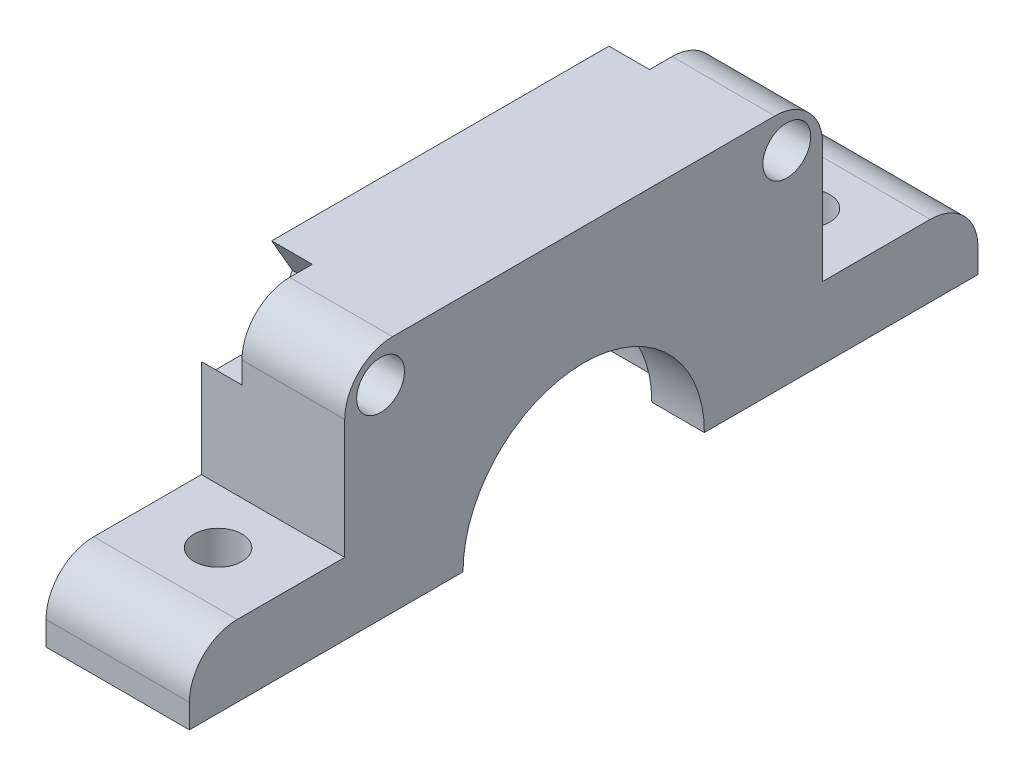
ISO-10303-21;
HEADER;
FILE_DESCRIPTION(('STEP AP214'),'2;1');
FILE_NAME('part.step','',(''),(''),'','','');
FILE_SCHEMA(('AUTOMOTIVE_DESIGN { 1 0 10303 214 1 1 1 1 }'));
ENDSEC;
DATA;
#1=APPLICATION_CONTEXT('core data for automotive mechanical design processes');
#2=APPLICATION_PROTOCOL_DEFINITION('international standard','automotive_design',2000,#1);
#3=PRODUCT_CONTEXT('',#1,'mechanical');
#4=PRODUCT('Part','Part','',(#3));
#5=PRODUCT_RELATED_PRODUCT_CATEGORY('part','',(#4));
#6=PRODUCT_DEFINITION_FORMATION('','',#4);
#7=PRODUCT_DEFINITION_CONTEXT('part definition',#1,'design');
#8=PRODUCT_DEFINITION('design','',#6,#7);
#9=PRODUCT_DEFINITION_SHAPE('','',#8);
#10=(LENGTH_UNIT() NAMED_UNIT(*) SI_UNIT(.MILLI.,.METRE.));
#11=(NAMED_UNIT(*) PLANE_ANGLE_UNIT() SI_UNIT($,.RADIAN.));
#12=(NAMED_UNIT(*) SI_UNIT($,.STERADIAN.) SOLID_ANGLE_UNIT());
#13=UNCERTAINTY_MEASURE_WITH_UNIT(LENGTH_MEASURE(1.E-05),#10,'distance_accuracy_value','');
#14=(GEOMETRIC_REPRESENTATION_CONTEXT(3) GLOBAL_UNCERTAINTY_ASSIGNED_CONTEXT((#13)) GLOBAL_UNIT_ASSIGNED_CONTEXT((#10,
#11,#12)) REPRESENTATION_CONTEXT('',''));
#15=CARTESIAN_POINT('',(0.,0.,0.));
#16=DIRECTION('',(0.,0.,1.));
#17=DIRECTION('',(1.,0.,0.));
#18=AXIS2_PLACEMENT_3D('',#15,#16,#17);
#19=CARTESIAN_POINT('',(3.92156862745098,8.,-14.7941176470588));
#20=DIRECTION('',(1.,0.,0.));
#21=DIRECTION('',(0.,0.,-1.));
#22=AXIS2_PLACEMENT_3D('',#19,#20,#21);
#23=CYLINDRICAL_SURFACE('',#22,2.);
#24=DIRECTION('',(1.,0.,0.));
#25=VECTOR('',#24,1.);
#26=CARTESIAN_POINT('',(3.92156862745098,8.,-16.7941176470588));
#27=LINE('',#26,#25);
#28=CARTESIAN_POINT('',(5.62156862745098,8.,-16.7941176470588));
#29=VERTEX_POINT('',#28);
#30=CARTESIAN_POINT('',(9.92156862745098,8.,-16.7941176470588));
#31=VERTEX_POINT('',#30);
#32=EDGE_CURVE('E373',#29,#31,#27,.T.);
#33=ORIENTED_EDGE('',*,*,#32,.F.);
#34=CARTESIAN_POINT('',(5.62156862745098,8.,-14.7941176470588));
#35=DIRECTION('',(-1.,0.,0.));
#36=DIRECTION('',(0.,0.,1.));
#37=AXIS2_PLACEMENT_3D('',#34,#35,#36);
#38=CIRCLE('',#37,2.);
#39=CARTESIAN_POINT('',(5.62156862745098,10.,-14.7941176470588));
#40=VERTEX_POINT('',#39);
#41=EDGE_CURVE('E285',#29,#40,#38,.F.);
#42=ORIENTED_EDGE('',*,*,#41,.T.);
#43=DIRECTION('',(1.,0.,0.));
#44=VECTOR('',#43,1.);
#45=CARTESIAN_POINT('',(3.92156862745098,10.,-14.7941176470588));
#46=LINE('',#45,#44);
#47=CARTESIAN_POINT('',(9.92156862745098,10.,-14.7941176470588));
#48=VERTEX_POINT('',#47);
#49=EDGE_CURVE('E381',#48,#40,#46,.F.);
#50=ORIENTED_EDGE('',*,*,#49,.F.);
#51=CARTESIAN_POINT('',(9.92156862745098,8.,-14.7941176470588));
#52=DIRECTION('',(-1.,0.,0.));
#53=DIRECTION('',(0.,0.,1.));
#54=AXIS2_PLACEMENT_3D('',#51,#52,#53);
#55=CIRCLE('',#54,2.);
#56=EDGE_CURVE('E377',#31,#48,#55,.F.);
#57=ORIENTED_EDGE('',*,*,#56,.F.);
#58=EDGE_LOOP('',(#33,#42,#50,#57));
#59=FACE_BOUND('',#58,.T.);
#60=ADVANCED_FACE('F38',(#59),#23,.T.);
#61=CARTESIAN_POINT('',(3.92156862745098,8.,1.20588235294118));
#62=DIRECTION('',(1.,0.,0.));
#63=DIRECTION('',(0.,0.,-1.));
#64=AXIS2_PLACEMENT_3D('',#61,#62,#63);
#65=CYLINDRICAL_SURFACE('',#64,2.);
#66=DIRECTION('',(1.,0.,0.));
#67=VECTOR('',#66,1.);
#68=CARTESIAN_POINT('',(3.92156862745098,10.,1.20588235294118));
#69=LINE('',#68,#67);
#70=CARTESIAN_POINT('',(5.62156862745098,10.,1.20588235294118));
#71=VERTEX_POINT('',#70);
#72=CARTESIAN_POINT('',(9.92156862745098,10.,1.20588235294118));
#73=VERTEX_POINT('',#72);
#74=EDGE_CURVE('E379',#71,#73,#69,.T.);
#75=ORIENTED_EDGE('',*,*,#74,.F.);
#76=CARTESIAN_POINT('',(5.62156862745098,8.,1.20588235294118));
#77=DIRECTION('',(-1.,0.,0.));
#78=DIRECTION('',(0.,0.,1.));
#79=AXIS2_PLACEMENT_3D('',#76,#77,#78);
#80=CIRCLE('',#79,2.);
#81=CARTESIAN_POINT('',(5.62156862745098,8.,3.20588235294118));
#82=VERTEX_POINT('',#81);
#83=EDGE_CURVE('E280',#71,#82,#80,.F.);
#84=ORIENTED_EDGE('',*,*,#83,.T.);
#85=DIRECTION('',(1.,0.,0.));
#86=VECTOR('',#85,1.);
#87=CARTESIAN_POINT('',(3.92156862745098,8.,3.20588235294118));
#88=LINE('',#87,#86);
#89=CARTESIAN_POINT('',(9.92156862745098,7.99999999999999,3.20588235294118));
#90=VERTEX_POINT('',#89);
#91=EDGE_CURVE('E384',#90,#82,#88,.F.);
#92=ORIENTED_EDGE('',*,*,#91,.F.);
#93=CARTESIAN_POINT('',(9.92156862745098,8.,1.20588235294118));
#94=DIRECTION('',(-1.,0.,0.));
#95=DIRECTION('',(0.,0.,1.));
#96=AXIS2_PLACEMENT_3D('',#93,#94,#95);
#97=CIRCLE('',#96,2.);
#98=EDGE_CURVE('E375',#73,#90,#97,.F.);
#99=ORIENTED_EDGE('',*,*,#98,.F.);
#100=EDGE_LOOP('',(#75,#84,#92,#99));
#101=FACE_BOUND('',#100,.T.);
#102=ADVANCED_FACE('F516',(#101),#65,.T.);
#103=CARTESIAN_POINT('',(-5.07843137254902,8.5,-15.2941176470588));
#104=DIRECTION('',(1.,0.,0.));
#105=DIRECTION('',(0.,0.,-1.));
#106=AXIS2_PLACEMENT_3D('',#103,#104,#105);
#107=CYLINDRICAL_SURFACE('',#106,1.00000000000001);
#108=CARTESIAN_POINT('',(9.92156862745098,8.5,-15.2941176470588));
#109=DIRECTION('',(1.,0.,0.));
#110=DIRECTION('',(0.,0.,-1.));
#111=AXIS2_PLACEMENT_3D('',#108,#109,#110);
#112=CIRCLE('',#111,1.00000000000001);
#113=CARTESIAN_POINT('',(9.92156862745098,8.5,-16.2941176470588));
#114=VERTEX_POINT('',#113);
#115=EDGE_CURVE('E291',#114,#114,#112,.T.);
#116=ORIENTED_EDGE('',*,*,#115,.T.);
#117=EDGE_LOOP('',(#116));
#118=FACE_BOUND('',#117,.T.);
#119=CARTESIAN_POINT('',(5.62156862745098,8.5,-15.2941176470588));
#120=DIRECTION('',(-1.,0.,0.));
#121=DIRECTION('',(0.,0.,1.));
#122=AXIS2_PLACEMENT_3D('',#119,#120,#121);
#123=CIRCLE('',#122,1.00000000000001);
#124=CARTESIAN_POINT('',(5.62156862745098,8.5,-14.2941176470588));
#125=VERTEX_POINT('',#124);
#126=EDGE_CURVE('E284',#125,#125,#123,.F.);
#127=ORIENTED_EDGE('',*,*,#126,.F.);
#128=EDGE_LOOP('',(#127));
#129=FACE_BOUND('',#128,.T.);
#130=ADVANCED_FACE('F526',(#118,#129),#107,.F.);
#131=CARTESIAN_POINT('',(-5.07843137254902,8.5,1.70588235294118));
#132=DIRECTION('',(1.,0.,0.));
#133=DIRECTION('',(0.,0.,-1.));
#134=AXIS2_PLACEMENT_3D('',#131,#132,#133);
#135=CYLINDRICAL_SURFACE('',#134,1.);
#136=CARTESIAN_POINT('',(9.92156862745098,8.5,1.70588235294118));
#137=DIRECTION('',(1.,0.,0.));
#138=DIRECTION('',(0.,0.,-1.));
#139=AXIS2_PLACEMENT_3D('',#136,#137,#138);
#140=CIRCLE('',#139,1.);
#141=CARTESIAN_POINT('',(9.92156862745098,8.5,0.705882352941176));
#142=VERTEX_POINT('',#141);
#143=EDGE_CURVE('E292',#142,#142,#140,.T.);
#144=ORIENTED_EDGE('',*,*,#143,.T.);
#145=EDGE_LOOP('',(#144));
#146=FACE_BOUND('',#145,.T.);
#147=CARTESIAN_POINT('',(5.62156862745098,8.5,1.70588235294118));
#148=DIRECTION('',(-1.,0.,0.));
#149=DIRECTION('',(0.,0.,1.));
#150=AXIS2_PLACEMENT_3D('',#147,#148,#149);
#151=CIRCLE('',#150,1.);
#152=CARTESIAN_POINT('',(5.62156862745098,8.5,2.70588235294118));
#153=VERTEX_POINT('',#152);
#154=EDGE_CURVE('E252',#153,#153,#151,.F.);
#155=ORIENTED_EDGE('',*,*,#154,.F.);
#156=EDGE_LOOP('',(#155));
#157=FACE_BOUND('',#156,.T.);
#158=ADVANCED_FACE('F551',(#146,#157),#135,.F.);
#159=CARTESIAN_POINT('',(46.921568627451,0.,-6.79411764705883));
#160=DIRECTION('',(-1.,0.,0.));
#161=DIRECTION('',(0.,0.,1.));
#162=AXIS2_PLACEMENT_3D('',#159,#160,#161);
#163=CYLINDRICAL_SURFACE('',#162,5.05);
#164=CARTESIAN_POINT('',(7.72156862745098,0.,-6.79411764705883));
#165=DIRECTION('',(-1.,0.,0.));
#166=DIRECTION('',(0.,0.,1.));
#167=AXIS2_PLACEMENT_3D('',#164,#165,#166);
#168=CIRCLE('',#167,5.05);
#169=CARTESIAN_POINT('',(7.72156862745098,0.,-11.8441176470588));
#170=VERTEX_POINT('',#169);
#171=CARTESIAN_POINT('',(7.72156862745098,0.,-1.74411764705883));
#172=VERTEX_POINT('',#171);
#173=EDGE_CURVE('E392',#170,#172,#168,.F.);
#174=ORIENTED_EDGE('',*,*,#173,.F.);
#175=DIRECTION('',(-1.,0.,0.));
#176=VECTOR('',#175,1.);
#177=CARTESIAN_POINT('',(46.921568627451,0.,-11.8441176470588));
#178=LINE('',#177,#176);
#179=CARTESIAN_POINT('',(9.92156862745097,0.,-11.8441176470588));
#180=VERTEX_POINT('',#179);
#181=EDGE_CURVE('E389',#180,#170,#178,.T.);
#182=ORIENTED_EDGE('',*,*,#181,.F.);
#183=CARTESIAN_POINT('',(9.92156862745098,0.,-6.79411764705883));
#184=DIRECTION('',(-1.,0.,0.));
#185=DIRECTION('',(0.,0.,1.));
#186=AXIS2_PLACEMENT_3D('',#183,#184,#185);
#187=CIRCLE('',#186,5.05);
#188=CARTESIAN_POINT('',(9.92156862745098,0.,-1.74411764705883));
#189=VERTEX_POINT('',#188);
#190=EDGE_CURVE('E319',#189,#180,#187,.T.);
#191=ORIENTED_EDGE('',*,*,#190,.F.);
#192=DIRECTION('',(-1.,0.,0.));
#193=VECTOR('',#192,1.);
#194=CARTESIAN_POINT('',(46.921568627451,0.,-1.74411764705883));
#195=LINE('',#194,#193);
#196=EDGE_CURVE('E387',#172,#189,#195,.F.);
#197=ORIENTED_EDGE('',*,*,#196,.F.);
#198=EDGE_LOOP('',(#174,#182,#191,#197));
#199=FACE_BOUND('',#198,.T.);
#200=ADVANCED_FACE('F548',(#199),#163,.F.);
#201=CARTESIAN_POINT('',(0.,0.,0.));
#202=DIRECTION('',(0.,1.,0.));
#203=DIRECTION('',(0.,0.,1.));
#204=AXIS2_PLACEMENT_3D('',#201,#202,#203);
#205=PLANE('',#204);
#206=CARTESIAN_POINT('',(6.92156862745097,0.,-19.0941176470588));
#207=DIRECTION('',(0.,1.,0.));
#208=DIRECTION('',(0.,0.,1.));
#209=AXIS2_PLACEMENT_3D('',#206,#207,#208);
#210=CIRCLE('',#209,1.);
#211=CARTESIAN_POINT('',(6.92156862745097,0.,-18.0941176470588));
#212=VERTEX_POINT('',#211);
#213=EDGE_CURVE('E304',#212,#212,#210,.T.);
#214=ORIENTED_EDGE('',*,*,#213,.T.);
#215=EDGE_LOOP('',(#214));
#216=FACE_BOUND('',#215,.T.);
#217=DIRECTION('',(0.,0.,1.));
#218=VECTOR('',#217,1.);
#219=CARTESIAN_POINT('',(7.72156862745098,0.,0.));
#220=LINE('',#219,#218);
#221=CARTESIAN_POINT('',(7.72156862745098,0.,-12.8441176470588));
#222=VERTEX_POINT('',#221);
#223=EDGE_CURVE('E314',#222,#170,#220,.T.);
#224=ORIENTED_EDGE('',*,*,#223,.F.);
#225=DIRECTION('',(-1.,0.,0.));
#226=VECTOR('',#225,1.);
#227=CARTESIAN_POINT('',(7.72156862745098,0.,-12.8441176470588));
#228=LINE('',#227,#226);
#229=CARTESIAN_POINT('',(3.92156862745098,0.,-12.8441176470588));
#230=VERTEX_POINT('',#229);
#231=EDGE_CURVE('E316',#222,#230,#228,.T.);
#232=ORIENTED_EDGE('',*,*,#231,.T.);
#233=DIRECTION('',(0.,0.,1.));
#234=VECTOR('',#233,1.);
#235=CARTESIAN_POINT('',(3.92156862745098,0.,-23.2941176470588));
#236=LINE('',#235,#234);
#237=CARTESIAN_POINT('',(3.92156862745098,0.,-23.2941176470588));
#238=VERTEX_POINT('',#237);
#239=EDGE_CURVE('E353',#238,#230,#236,.T.);
#240=ORIENTED_EDGE('',*,*,#239,.F.);
#241=DIRECTION('',(-1.,0.,0.));
#242=VECTOR('',#241,1.);
#243=CARTESIAN_POINT('',(3.92156862745098,0.,-23.2941176470588));
#244=LINE('',#243,#242);
#245=CARTESIAN_POINT('',(9.92156862745098,0.,-23.2941176470588));
#246=VERTEX_POINT('',#245);
#247=EDGE_CURVE('E363',#246,#238,#244,.T.);
#248=ORIENTED_EDGE('',*,*,#247,.F.);
#249=DIRECTION('',(0.,0.,-1.));
#250=VECTOR('',#249,1.);
#251=CARTESIAN_POINT('',(9.92156862745098,0.,-23.2941176470588));
#252=LINE('',#251,#250);
#253=EDGE_CURVE('E359',#180,#246,#252,.T.);
#254=ORIENTED_EDGE('',*,*,#253,.F.);
#255=ORIENTED_EDGE('',*,*,#181,.T.);
#256=EDGE_LOOP('',(#224,#232,#240,#248,#254,#255));
#257=FACE_BOUND('',#256,.T.);
#258=ADVANCED_FACE('F479',(#216,#257),#205,.F.);
#259=CARTESIAN_POINT('',(0.,3.,0.));
#260=DIRECTION('',(0.,1.,0.));
#261=DIRECTION('',(0.,0.,1.));
#262=AXIS2_PLACEMENT_3D('',#259,#260,#261);
#263=PLANE('',#262);
#264=CARTESIAN_POINT('',(6.92156862745098,3.,5.50588235294118));
#265=DIRECTION('',(0.,1.,0.));
#266=DIRECTION('',(0.,0.,1.));
#267=AXIS2_PLACEMENT_3D('',#264,#265,#266);
#268=CIRCLE('',#267,1.);
#269=CARTESIAN_POINT('',(6.92156862745098,3.,6.50588235294118));
#270=VERTEX_POINT('',#269);
#271=EDGE_CURVE('E298',#270,#270,#268,.T.);
#272=ORIENTED_EDGE('',*,*,#271,.F.);
#273=EDGE_LOOP('',(#272));
#274=FACE_BOUND('',#273,.T.);
#275=DIRECTION('',(0.,0.,1.));
#276=VECTOR('',#275,1.);
#277=CARTESIAN_POINT('',(3.92156862745098,3.,-23.2941176470588));
#278=LINE('',#277,#276);
#279=CARTESIAN_POINT('',(3.92156862745098,3.,3.20588235294118));
#280=VERTEX_POINT('',#279);
#281=CARTESIAN_POINT('',(3.92156862745098,3.,7.70588235294117));
#282=VERTEX_POINT('',#281);
#283=EDGE_CURVE('E349',#280,#282,#278,.T.);
#284=ORIENTED_EDGE('',*,*,#283,.T.);
#285=DIRECTION('',(1.,0.,0.));
#286=VECTOR('',#285,1.);
#287=CARTESIAN_POINT('',(9.92156862745098,3.,7.70588235294118));
#288=LINE('',#287,#286);
#289=CARTESIAN_POINT('',(9.92156862745098,3.,7.70588235294118));
#290=VERTEX_POINT('',#289);
#291=EDGE_CURVE('E410',#282,#290,#288,.T.);
#292=ORIENTED_EDGE('',*,*,#291,.T.);
#293=DIRECTION('',(0.,0.,-1.));
#294=VECTOR('',#293,1.);
#295=CARTESIAN_POINT('',(9.92156862745098,3.,-23.2941176470588));
#296=LINE('',#295,#294);
#297=CARTESIAN_POINT('',(9.92156862745098,3.,3.20588235294118));
#298=VERTEX_POINT('',#297);
#299=EDGE_CURVE('E350',#290,#298,#296,.T.);
#300=ORIENTED_EDGE('',*,*,#299,.T.);
#301=DIRECTION('',(1.,0.,0.));
#302=VECTOR('',#301,1.);
#303=CARTESIAN_POINT('',(0.,3.,3.20588235294118));
#304=LINE('',#303,#302);
#305=EDGE_CURVE('E342',#280,#298,#304,.T.);
#306=ORIENTED_EDGE('',*,*,#305,.F.);
#307=EDGE_LOOP('',(#284,#292,#300,#306));
#308=FACE_BOUND('',#307,.T.);
#309=ADVANCED_FACE('F501',(#274,#308),#263,.T.);
#310=CARTESIAN_POINT('',(3.92156862745098,3.,-23.2941176470588));
#311=DIRECTION('',(1.,0.,0.));
#312=DIRECTION('',(0.,0.,-1.));
#313=AXIS2_PLACEMENT_3D('',#310,#311,#312);
#314=PLANE('',#313);
#315=DIRECTION('',(0.,-0.866025403784439,0.5));
#316=VECTOR('',#315,1.);
#317=CARTESIAN_POINT('',(3.92156862745098,8.5,-0.603518723817325));
#318=LINE('',#317,#316);
#319=CARTESIAN_POINT('',(3.92156862745098,8.5,-0.603518723817325));
#320=VERTEX_POINT('',#319);
#321=CARTESIAN_POINT('',(3.92156862745098,6.5,0.551181814561926));
#322=VERTEX_POINT('',#321);
#323=EDGE_CURVE('E243',#320,#322,#318,.T.);
#324=ORIENTED_EDGE('',*,*,#323,.F.);
#325=DIRECTION('',(0.,-0.866025403784439,-0.5));
#326=VECTOR('',#325,1.);
#327=CARTESIAN_POINT('',(3.92156862745098,10.5,0.551181814561925));
#328=LINE('',#327,#326);
#329=CARTESIAN_POINT('',(3.92156862745098,10.,0.262506679967113));
#330=VERTEX_POINT('',#329);
#331=EDGE_CURVE('E228',#330,#320,#328,.T.);
#332=ORIENTED_EDGE('',*,*,#331,.F.);
#333=DIRECTION('',(0.,0.,1.));
#334=VECTOR('',#333,1.);
#335=CARTESIAN_POINT('',(3.92156862745098,10.,3.20588235294118));
#336=LINE('',#335,#334);
#337=CARTESIAN_POINT('',(3.92156862745097,10.,-13.8507419740848));
#338=VERTEX_POINT('',#337);
#339=EDGE_CURVE('E326',#338,#330,#336,.T.);
#340=ORIENTED_EDGE('',*,*,#339,.F.);
#341=DIRECTION('',(0.,0.866025403784439,-0.5));
#342=VECTOR('',#341,1.);
#343=CARTESIAN_POINT('',(3.92156862745098,8.5,-12.9847165703003));
#344=LINE('',#343,#342);
#345=CARTESIAN_POINT('',(3.92156862745098,8.5,-12.9847165703003));
#346=VERTEX_POINT('',#345);
#347=EDGE_CURVE('E257',#346,#338,#344,.T.);
#348=ORIENTED_EDGE('',*,*,#347,.F.);
#349=DIRECTION('',(0.,0.866025403784439,0.5));
#350=VECTOR('',#349,1.);
#351=CARTESIAN_POINT('',(3.92156862745098,6.5,-14.1394171086796));
#352=LINE('',#351,#350);
#353=CARTESIAN_POINT('',(3.92156862745098,6.5,-14.1394171086796));
#354=VERTEX_POINT('',#353);
#355=EDGE_CURVE('E271',#354,#346,#352,.T.);
#356=ORIENTED_EDGE('',*,*,#355,.F.);
#357=DIRECTION('',(0.,0.,1.));
#358=VECTOR('',#357,1.);
#359=CARTESIAN_POINT('',(3.92156862745098,6.5,-16.4488181854381));
#360=LINE('',#359,#358);
#361=CARTESIAN_POINT('',(3.92156862745098,6.5,-16.4488181854381));
#362=VERTEX_POINT('',#361);
#363=EDGE_CURVE('E268',#362,#354,#360,.T.);
#364=ORIENTED_EDGE('',*,*,#363,.F.);
#365=DIRECTION('',(0.,-0.866025403784439,0.5));
#366=VECTOR('',#365,1.);
#367=CARTESIAN_POINT('',(3.92156862745098,8.5,-17.6035187238173));
#368=LINE('',#367,#366);
#369=CARTESIAN_POINT('',(3.92156862745098,7.09807621135333,-16.7941176470588));
#370=VERTEX_POINT('',#369);
#371=EDGE_CURVE('E266',#370,#362,#368,.T.);
#372=ORIENTED_EDGE('',*,*,#371,.F.);
#373=DIRECTION('',(0.,1.,0.));
#374=VECTOR('',#373,1.);
#375=CARTESIAN_POINT('',(3.92156862745098,0.,-16.7941176470588));
#376=LINE('',#375,#374);
#377=CARTESIAN_POINT('',(3.92156862745098,3.,-16.7941176470588));
#378=VERTEX_POINT('',#377);
#379=EDGE_CURVE('E323',#378,#370,#376,.T.);
#380=ORIENTED_EDGE('',*,*,#379,.F.);
#381=CARTESIAN_POINT('',(3.92156862745098,3.,-21.2941176470588));
#382=VERTEX_POINT('',#381);
#383=EDGE_CURVE('E346',#382,#378,#278,.T.);
#384=ORIENTED_EDGE('',*,*,#383,.F.);
#385=CARTESIAN_POINT('',(3.92156862745098,1.,-21.2941176470588));
#386=DIRECTION('',(1.,0.,0.));
#387=DIRECTION('',(0.,0.,-1.));
#388=AXIS2_PLACEMENT_3D('',#385,#386,#387);
#389=CIRCLE('',#388,2.);
#390=CARTESIAN_POINT('',(3.92156862745098,1.,-23.2941176470588));
#391=VERTEX_POINT('',#390);
#392=EDGE_CURVE('E402',#382,#391,#389,.F.);
#393=ORIENTED_EDGE('',*,*,#392,.T.);
#394=DIRECTION('',(0.,-1.,0.));
#395=VECTOR('',#394,1.);
#396=CARTESIAN_POINT('',(3.92156862745098,3.,-23.2941176470588));
#397=LINE('',#396,#395);
#398=EDGE_CURVE('E352',#391,#238,#397,.T.);
#399=ORIENTED_EDGE('',*,*,#398,.T.);
#400=ORIENTED_EDGE('',*,*,#239,.T.);
#401=CARTESIAN_POINT('',(3.92156862745098,0.,-6.79411764705883));
#402=DIRECTION('',(-1.,0.,0.));
#403=DIRECTION('',(0.,0.,1.));
#404=AXIS2_PLACEMENT_3D('',#401,#402,#403);
#405=CIRCLE('',#404,6.05);
#406=CARTESIAN_POINT('',(3.92156862745098,0.,-0.744117647058826));
#407=VERTEX_POINT('',#406);
#408=EDGE_CURVE('E307',#407,#230,#405,.T.);
#409=ORIENTED_EDGE('',*,*,#408,.F.);
#410=CARTESIAN_POINT('',(3.92156862745098,0.,9.70588235294118));
#411=VERTEX_POINT('',#410);
#412=EDGE_CURVE('E345',#407,#411,#236,.T.);
#413=ORIENTED_EDGE('',*,*,#412,.T.);
#414=DIRECTION('',(0.,-1.,0.));
#415=VECTOR('',#414,1.);
#416=CARTESIAN_POINT('',(3.92156862745098,3.,9.70588235294118));
#417=LINE('',#416,#415);
#418=CARTESIAN_POINT('',(3.92156862745098,1.,9.70588235294118));
#419=VERTEX_POINT('',#418);
#420=EDGE_CURVE('E371',#419,#411,#417,.T.);
#421=ORIENTED_EDGE('',*,*,#420,.F.);
#422=CARTESIAN_POINT('',(3.92156862745098,1.,7.70588235294117));
#423=DIRECTION('',(1.,0.,0.));
#424=DIRECTION('',(0.,0.,-1.));
#425=AXIS2_PLACEMENT_3D('',#422,#423,#424);
#426=CIRCLE('',#425,2.);
#427=EDGE_CURVE('E400',#419,#282,#426,.F.);
#428=ORIENTED_EDGE('',*,*,#427,.T.);
#429=ORIENTED_EDGE('',*,*,#283,.F.);
#430=DIRECTION('',(0.,-1.,0.));
#431=VECTOR('',#430,1.);
#432=CARTESIAN_POINT('',(3.92156862745098,0.,3.20588235294118));
#433=LINE('',#432,#431);
#434=CARTESIAN_POINT('',(3.92156862745098,7.09807621135332,3.20588235294118));
#435=VERTEX_POINT('',#434);
#436=EDGE_CURVE('E330',#435,#280,#433,.T.);
#437=ORIENTED_EDGE('',*,*,#436,.F.);
#438=DIRECTION('',(0.,0.866025403784439,0.5));
#439=VECTOR('',#438,1.);
#440=CARTESIAN_POINT('',(3.92156862745098,6.5,2.86058289132043));
#441=LINE('',#440,#439);
#442=CARTESIAN_POINT('',(3.92156862745098,6.5,2.86058289132043));
#443=VERTEX_POINT('',#442);
#444=EDGE_CURVE('E222',#443,#435,#441,.T.);
#445=ORIENTED_EDGE('',*,*,#444,.F.);
#446=DIRECTION('',(0.,0.,1.));
#447=VECTOR('',#446,1.);
#448=CARTESIAN_POINT('',(3.92156862745098,6.5,0.551181814561926));
#449=LINE('',#448,#447);
#450=EDGE_CURVE('E246',#322,#443,#449,.T.);
#451=ORIENTED_EDGE('',*,*,#450,.F.);
#452=EDGE_LOOP('',(#324,#332,#340,#348,#356,#364,#372,#380,#384,#393,#399,#400,#409,#413,#421,
#428,#429,#437,#445,#451));
#453=FACE_BOUND('',#452,.T.);
#454=ADVANCED_FACE('F427',(#453),#314,.F.);
#455=CARTESIAN_POINT('',(3.92156862745098,3.,9.70588235294118));
#456=DIRECTION('',(0.,0.,-1.));
#457=DIRECTION('',(-1.,0.,0.));
#458=AXIS2_PLACEMENT_3D('',#455,#456,#457);
#459=PLANE('',#458);
#460=DIRECTION('',(0.,-1.,0.));
#461=VECTOR('',#460,1.);
#462=CARTESIAN_POINT('',(9.92156862745098,3.,9.70588235294118));
#463=LINE('',#462,#461);
#464=CARTESIAN_POINT('',(9.92156862745098,1.,9.70588235294118));
#465=VERTEX_POINT('',#464);
#466=CARTESIAN_POINT('',(9.92156862745098,0.,9.70588235294118));
#467=VERTEX_POINT('',#466);
#468=EDGE_CURVE('E369',#465,#467,#463,.T.);
#469=ORIENTED_EDGE('',*,*,#468,.F.);
#470=DIRECTION('',(1.,0.,0.));
#471=VECTOR('',#470,1.);
#472=CARTESIAN_POINT('',(3.92156862745098,1.,9.70588235294118));
#473=LINE('',#472,#471);
#474=EDGE_CURVE('E413',#465,#419,#473,.F.);
#475=ORIENTED_EDGE('',*,*,#474,.T.);
#476=ORIENTED_EDGE('',*,*,#420,.T.);
#477=DIRECTION('',(1.,0.,0.));
#478=VECTOR('',#477,1.);
#479=CARTESIAN_POINT('',(3.92156862745098,0.,9.70588235294118));
#480=LINE('',#479,#478);
#481=EDGE_CURVE('E356',#411,#467,#480,.T.);
#482=ORIENTED_EDGE('',*,*,#481,.T.);
#483=EDGE_LOOP('',(#469,#475,#476,#482));
#484=FACE_BOUND('',#483,.T.);
#485=ADVANCED_FACE('F492',(#484),#459,.F.);
#486=CARTESIAN_POINT('',(9.92156862745098,3.,-23.2941176470588));
#487=DIRECTION('',(-1.,0.,0.));
#488=DIRECTION('',(0.,0.,1.));
#489=AXIS2_PLACEMENT_3D('',#486,#487,#488);
#490=PLANE('',#489);
#491=ORIENTED_EDGE('',*,*,#143,.F.);
#492=EDGE_LOOP('',(#491));
#493=FACE_BOUND('',#492,.T.);
#494=ORIENTED_EDGE('',*,*,#115,.F.);
#495=EDGE_LOOP('',(#494));
#496=FACE_BOUND('',#495,.T.);
#497=DIRECTION('',(0.,-1.,0.));
#498=VECTOR('',#497,1.);
#499=CARTESIAN_POINT('',(9.92156862745098,3.,-23.2941176470588));
#500=LINE('',#499,#498);
#501=CARTESIAN_POINT('',(9.92156862745098,1.,-23.2941176470588));
#502=VERTEX_POINT('',#501);
#503=EDGE_CURVE('E367',#502,#246,#500,.T.);
#504=ORIENTED_EDGE('',*,*,#503,.F.);
#505=CARTESIAN_POINT('',(9.92156862745098,1.,-21.2941176470588));
#506=DIRECTION('',(-1.,0.,0.));
#507=DIRECTION('',(0.,0.,1.));
#508=AXIS2_PLACEMENT_3D('',#505,#506,#507);
#509=CIRCLE('',#508,2.);
#510=CARTESIAN_POINT('',(9.92156862745098,3.,-21.2941176470588));
#511=VERTEX_POINT('',#510);
#512=EDGE_CURVE('E408',#502,#511,#509,.F.);
#513=ORIENTED_EDGE('',*,*,#512,.T.);
#514=CARTESIAN_POINT('',(9.92156862745098,3.,-16.7941176470588));
#515=VERTEX_POINT('',#514);
#516=EDGE_CURVE('E348',#515,#511,#296,.T.);
#517=ORIENTED_EDGE('',*,*,#516,.F.);
#518=DIRECTION('',(0.,1.,0.));
#519=VECTOR('',#518,1.);
#520=CARTESIAN_POINT('',(9.92156862745098,0.,-16.7941176470588));
#521=LINE('',#520,#519);
#522=EDGE_CURVE('E322',#515,#31,#521,.T.);
#523=ORIENTED_EDGE('',*,*,#522,.T.);
#524=ORIENTED_EDGE('',*,*,#56,.T.);
#525=DIRECTION('',(0.,0.,1.));
#526=VECTOR('',#525,1.);
#527=CARTESIAN_POINT('',(9.92156862745098,10.,3.20588235294118));
#528=LINE('',#527,#526);
#529=EDGE_CURVE('E335',#48,#73,#528,.T.);
#530=ORIENTED_EDGE('',*,*,#529,.T.);
#531=ORIENTED_EDGE('',*,*,#98,.T.);
#532=DIRECTION('',(0.,-1.,0.));
#533=VECTOR('',#532,1.);
#534=CARTESIAN_POINT('',(9.92156862745098,0.,3.20588235294118));
#535=LINE('',#534,#533);
#536=EDGE_CURVE('E327',#90,#298,#535,.T.);
#537=ORIENTED_EDGE('',*,*,#536,.T.);
#538=ORIENTED_EDGE('',*,*,#299,.F.);
#539=CARTESIAN_POINT('',(9.92156862745098,1.,7.70588235294118));
#540=DIRECTION('',(-1.,0.,0.));
#541=DIRECTION('',(0.,0.,1.));
#542=AXIS2_PLACEMENT_3D('',#539,#540,#541);
#543=CIRCLE('',#542,2.);
#544=EDGE_CURVE('E406',#290,#465,#543,.F.);
#545=ORIENTED_EDGE('',*,*,#544,.T.);
#546=ORIENTED_EDGE('',*,*,#468,.T.);
#547=EDGE_CURVE('E360',#467,#189,#252,.T.);
#548=ORIENTED_EDGE('',*,*,#547,.T.);
#549=ORIENTED_EDGE('',*,*,#190,.T.);
#550=ORIENTED_EDGE('',*,*,#253,.T.);
#551=EDGE_LOOP('',(#504,#513,#517,#523,#524,#530,#531,#537,#538,#545,#546,#548,#549,#550));
#552=FACE_BOUND('',#551,.T.);
#553=ADVANCED_FACE('F472',(#493,#496,#552),#490,.F.);
#554=CARTESIAN_POINT('',(3.92156862745098,3.,-23.2941176470588));
#555=DIRECTION('',(0.,0.,1.));
#556=DIRECTION('',(1.,0.,0.));
#557=AXIS2_PLACEMENT_3D('',#554,#555,#556);
#558=PLANE('',#557);
#559=ORIENTED_EDGE('',*,*,#398,.F.);
#560=DIRECTION('',(-1.,0.,0.));
#561=VECTOR('',#560,1.);
#562=CARTESIAN_POINT('',(9.92156862745098,1.,-23.2941176470588));
#563=LINE('',#562,#561);
#564=EDGE_CURVE('E404',#391,#502,#563,.F.);
#565=ORIENTED_EDGE('',*,*,#564,.T.);
#566=ORIENTED_EDGE('',*,*,#503,.T.);
#567=ORIENTED_EDGE('',*,*,#247,.T.);
#568=EDGE_LOOP('',(#559,#565,#566,#567));
#569=FACE_BOUND('',#568,.T.);
#570=ADVANCED_FACE('F469',(#569),#558,.F.);
#571=CARTESIAN_POINT('',(6.92156862745097,3.,-19.0941176470588));
#572=DIRECTION('',(0.,1.,0.));
#573=DIRECTION('',(0.,0.,1.));
#574=AXIS2_PLACEMENT_3D('',#571,#572,#573);
#575=CIRCLE('',#574,1.);
#576=CARTESIAN_POINT('',(6.92156862745097,3.,-18.0941176470588));
#577=VERTEX_POINT('',#576);
#578=EDGE_CURVE('E295',#577,#577,#575,.T.);
#579=ORIENTED_EDGE('',*,*,#578,.F.);
#580=EDGE_LOOP('',(#579));
#581=FACE_BOUND('',#580,.T.);
#582=ORIENTED_EDGE('',*,*,#516,.T.);
#583=DIRECTION('',(-1.,0.,0.));
#584=VECTOR('',#583,1.);
#585=CARTESIAN_POINT('',(3.92156862745098,3.,-21.2941176470588));
#586=LINE('',#585,#584);
#587=EDGE_CURVE('E397',#511,#382,#586,.T.);
#588=ORIENTED_EDGE('',*,*,#587,.T.);
#589=ORIENTED_EDGE('',*,*,#383,.T.);
#590=DIRECTION('',(-1.,0.,0.));
#591=VECTOR('',#590,1.);
#592=CARTESIAN_POINT('',(0.,3.,-16.7941176470588));
#593=LINE('',#592,#591);
#594=EDGE_CURVE('E332',#515,#378,#593,.T.);
#595=ORIENTED_EDGE('',*,*,#594,.F.);
#596=EDGE_LOOP('',(#582,#588,#589,#595));
#597=FACE_BOUND('',#596,.T.);
#598=ADVANCED_FACE('F461',(#581,#597),#263,.T.);
#599=CARTESIAN_POINT('',(6.92156862745098,0.,5.50588235294118));
#600=DIRECTION('',(0.,1.,0.));
#601=DIRECTION('',(0.,0.,1.));
#602=AXIS2_PLACEMENT_3D('',#599,#600,#601);
#603=CIRCLE('',#602,1.);
#604=CARTESIAN_POINT('',(6.92156862745098,0.,6.50588235294118));
#605=VERTEX_POINT('',#604);
#606=EDGE_CURVE('E301',#605,#605,#603,.T.);
#607=ORIENTED_EDGE('',*,*,#606,.T.);
#608=EDGE_LOOP('',(#607));
#609=FACE_BOUND('',#608,.T.);
#610=ORIENTED_EDGE('',*,*,#412,.F.);
#611=DIRECTION('',(-1.,0.,0.));
#612=VECTOR('',#611,1.);
#613=CARTESIAN_POINT('',(7.72156862745098,0.,-0.744117647058827));
#614=LINE('',#613,#612);
#615=CARTESIAN_POINT('',(7.72156862745098,0.,-0.744117647058827));
#616=VERTEX_POINT('',#615);
#617=EDGE_CURVE('E394',#407,#616,#614,.F.);
#618=ORIENTED_EDGE('',*,*,#617,.T.);
#619=DIRECTION('',(0.,0.,1.));
#620=VECTOR('',#619,1.);
#621=CARTESIAN_POINT('',(7.72156862745098,0.,0.));
#622=LINE('',#621,#620);
#623=EDGE_CURVE('E311',#172,#616,#622,.T.);
#624=ORIENTED_EDGE('',*,*,#623,.F.);
#625=ORIENTED_EDGE('',*,*,#196,.T.);
#626=ORIENTED_EDGE('',*,*,#547,.F.);
#627=ORIENTED_EDGE('',*,*,#481,.F.);
#628=EDGE_LOOP('',(#610,#618,#624,#625,#626,#627));
#629=FACE_BOUND('',#628,.T.);
#630=ADVANCED_FACE('F487',(#609,#629),#205,.F.);
#631=CARTESIAN_POINT('',(3.92156862745098,0.,3.20588235294118));
#632=DIRECTION('',(0.,0.,1.));
#633=DIRECTION('',(1.,0.,0.));
#634=AXIS2_PLACEMENT_3D('',#631,#632,#633);
#635=PLANE('',#634);
#636=DIRECTION('',(1.,0.,0.));
#637=VECTOR('',#636,1.);
#638=CARTESIAN_POINT('',(3.92156862745097,7.09807621135332,3.20588235294118));
#639=LINE('',#638,#637);
#640=CARTESIAN_POINT('',(5.62156862745098,7.09807621135332,3.20588235294118));
#641=VERTEX_POINT('',#640);
#642=EDGE_CURVE('E11',#435,#641,#639,.T.);
#643=ORIENTED_EDGE('',*,*,#642,.F.);
#644=ORIENTED_EDGE('',*,*,#436,.T.);
#645=ORIENTED_EDGE('',*,*,#305,.T.);
#646=ORIENTED_EDGE('',*,*,#536,.F.);
#647=ORIENTED_EDGE('',*,*,#91,.T.);
#648=DIRECTION('',(0.,-1.,0.));
#649=VECTOR('',#648,1.);
#650=CARTESIAN_POINT('',(5.62156862745098,0.,3.20588235294118));
#651=LINE('',#650,#649);
#652=EDGE_CURVE('E61',#82,#641,#651,.T.);
#653=ORIENTED_EDGE('',*,*,#652,.T.);
#654=EDGE_LOOP('',(#643,#644,#645,#646,#647,#653));
#655=FACE_BOUND('',#654,.T.);
#656=ADVANCED_FACE('F508',(#655),#635,.T.);
#657=CARTESIAN_POINT('',(3.92156862745098,10.,3.20588235294118));
#658=DIRECTION('',(0.,1.,0.));
#659=DIRECTION('',(0.,0.,1.));
#660=AXIS2_PLACEMENT_3D('',#657,#658,#659);
#661=PLANE('',#660);
#662=DIRECTION('',(-1.,0.,0.));
#663=VECTOR('',#662,1.);
#664=CARTESIAN_POINT('',(3.92156862745098,10.,0.262506679967113));
#665=LINE('',#664,#663);
#666=CARTESIAN_POINT('',(5.62156862745098,10.,0.262506679967112));
#667=VERTEX_POINT('',#666);
#668=EDGE_CURVE('E46',#667,#330,#665,.T.);
#669=ORIENTED_EDGE('',*,*,#668,.F.);
#670=DIRECTION('',(0.,0.,1.));
#671=VECTOR('',#670,1.);
#672=CARTESIAN_POINT('',(5.62156862745098,10.,3.20588235294118));
#673=LINE('',#672,#671);
#674=EDGE_CURVE('E219',#667,#71,#673,.T.);
#675=ORIENTED_EDGE('',*,*,#674,.T.);
#676=ORIENTED_EDGE('',*,*,#74,.T.);
#677=ORIENTED_EDGE('',*,*,#529,.F.);
#678=ORIENTED_EDGE('',*,*,#49,.T.);
#679=DIRECTION('',(0.,0.,1.));
#680=VECTOR('',#679,1.);
#681=CARTESIAN_POINT('',(5.62156862745099,10.,3.20588235294118));
#682=LINE('',#681,#680);
#683=CARTESIAN_POINT('',(5.62156862745098,10.,-13.8507419740848));
#684=VERTEX_POINT('',#683);
#685=EDGE_CURVE('E53',#40,#684,#682,.T.);
#686=ORIENTED_EDGE('',*,*,#685,.T.);
#687=DIRECTION('',(1.,0.,0.));
#688=VECTOR('',#687,1.);
#689=CARTESIAN_POINT('',(3.92156862745097,10.,-13.8507419740848));
#690=LINE('',#689,#688);
#691=EDGE_CURVE('E423',#338,#684,#690,.T.);
#692=ORIENTED_EDGE('',*,*,#691,.F.);
#693=ORIENTED_EDGE('',*,*,#339,.T.);
#694=EDGE_LOOP('',(#669,#675,#676,#677,#678,#686,#692,#693));
#695=FACE_BOUND('',#694,.T.);
#696=ADVANCED_FACE('F431',(#695),#661,.T.);
#697=CARTESIAN_POINT('',(3.92156862745098,0.,-16.7941176470588));
#698=DIRECTION('',(0.,0.,-1.));
#699=DIRECTION('',(0.,1.,0.));
#700=AXIS2_PLACEMENT_3D('',#697,#698,#699);
#701=PLANE('',#700);
#702=DIRECTION('',(-1.,0.,0.));
#703=VECTOR('',#702,1.);
#704=CARTESIAN_POINT('',(3.92156862745098,7.09807621135332,-16.7941176470588));
#705=LINE('',#704,#703);
#706=CARTESIAN_POINT('',(5.62156862745098,7.09807621135333,-16.7941176470588));
#707=VERTEX_POINT('',#706);
#708=EDGE_CURVE('E415',#707,#370,#705,.T.);
#709=ORIENTED_EDGE('',*,*,#708,.F.);
#710=DIRECTION('',(0.,1.,0.));
#711=VECTOR('',#710,1.);
#712=CARTESIAN_POINT('',(5.62156862745098,0.,-16.7941176470588));
#713=LINE('',#712,#711);
#714=EDGE_CURVE('E287',#707,#29,#713,.T.);
#715=ORIENTED_EDGE('',*,*,#714,.T.);
#716=ORIENTED_EDGE('',*,*,#32,.T.);
#717=ORIENTED_EDGE('',*,*,#522,.F.);
#718=ORIENTED_EDGE('',*,*,#594,.T.);
#719=ORIENTED_EDGE('',*,*,#379,.T.);
#720=EDGE_LOOP('',(#709,#715,#716,#717,#718,#719));
#721=FACE_BOUND('',#720,.T.);
#722=ADVANCED_FACE('F453',(#721),#701,.T.);
#723=CARTESIAN_POINT('',(7.72156862745098,0.,-6.79411764705883));
#724=DIRECTION('',(-1.,0.,0.));
#725=DIRECTION('',(0.,0.,1.));
#726=AXIS2_PLACEMENT_3D('',#723,#724,#725);
#727=CYLINDRICAL_SURFACE('',#726,6.05);
#728=CARTESIAN_POINT('',(7.72156862745098,0.,-6.79411764705883));
#729=DIRECTION('',(-1.,0.,0.));
#730=DIRECTION('',(0.,0.,1.));
#731=AXIS2_PLACEMENT_3D('',#728,#729,#730);
#732=CIRCLE('',#731,6.05);
#733=EDGE_CURVE('E308',#616,#222,#732,.T.);
#734=ORIENTED_EDGE('',*,*,#733,.F.);
#735=ORIENTED_EDGE('',*,*,#617,.F.);
#736=ORIENTED_EDGE('',*,*,#408,.T.);
#737=ORIENTED_EDGE('',*,*,#231,.F.);
#738=EDGE_LOOP('',(#734,#735,#736,#737));
#739=FACE_BOUND('',#738,.T.);
#740=ADVANCED_FACE('F537',(#739),#727,.F.);
#741=CARTESIAN_POINT('',(7.72156862745098,0.,-6.79411764705883));
#742=DIRECTION('',(-1.,0.,0.));
#743=DIRECTION('',(0.,0.,1.));
#744=AXIS2_PLACEMENT_3D('',#741,#742,#743);
#745=PLANE('',#744);
#746=ORIENTED_EDGE('',*,*,#223,.T.);
#747=ORIENTED_EDGE('',*,*,#173,.T.);
#748=ORIENTED_EDGE('',*,*,#623,.T.);
#749=ORIENTED_EDGE('',*,*,#733,.T.);
#750=EDGE_LOOP('',(#746,#747,#748,#749));
#751=FACE_BOUND('',#750,.T.);
#752=ADVANCED_FACE('F531',(#751),#745,.T.);
#753=CARTESIAN_POINT('',(0.,1.,-21.2941176470588));
#754=DIRECTION('',(1.,0.,0.));
#755=DIRECTION('',(0.,0.,-1.));
#756=AXIS2_PLACEMENT_3D('',#753,#754,#755);
#757=CYLINDRICAL_SURFACE('',#756,2.);
#758=ORIENTED_EDGE('',*,*,#512,.F.);
#759=ORIENTED_EDGE('',*,*,#564,.F.);
#760=ORIENTED_EDGE('',*,*,#392,.F.);
#761=ORIENTED_EDGE('',*,*,#587,.F.);
#762=EDGE_LOOP('',(#758,#759,#760,#761));
#763=FACE_BOUND('',#762,.T.);
#764=ADVANCED_FACE('F465',(#763),#757,.T.);
#765=CARTESIAN_POINT('',(0.,1.,7.70588235294117));
#766=DIRECTION('',(-1.,0.,0.));
#767=DIRECTION('',(0.,0.,1.));
#768=AXIS2_PLACEMENT_3D('',#765,#766,#767);
#769=CYLINDRICAL_SURFACE('',#768,2.);
#770=ORIENTED_EDGE('',*,*,#427,.F.);
#771=ORIENTED_EDGE('',*,*,#474,.F.);
#772=ORIENTED_EDGE('',*,*,#544,.F.);
#773=ORIENTED_EDGE('',*,*,#291,.F.);
#774=EDGE_LOOP('',(#770,#771,#772,#773));
#775=FACE_BOUND('',#774,.T.);
#776=ADVANCED_FACE('F40',(#775),#769,.T.);
#777=CARTESIAN_POINT('',(6.92156862745098,-0.8,5.50588235294118));
#778=DIRECTION('',(0.,1.,0.));
#779=DIRECTION('',(0.,0.,1.));
#780=AXIS2_PLACEMENT_3D('',#777,#778,#779);
#781=CYLINDRICAL_SURFACE('',#780,1.);
#782=ORIENTED_EDGE('',*,*,#271,.T.);
#783=EDGE_LOOP('',(#782));
#784=FACE_BOUND('',#783,.T.);
#785=ORIENTED_EDGE('',*,*,#606,.F.);
#786=EDGE_LOOP('',(#785));
#787=FACE_BOUND('',#786,.T.);
#788=ADVANCED_FACE('F536',(#784,#787),#781,.F.);
#789=CARTESIAN_POINT('',(6.92156862745097,-0.8,-19.0941176470588));
#790=DIRECTION('',(0.,1.,0.));
#791=DIRECTION('',(0.,0.,1.));
#792=AXIS2_PLACEMENT_3D('',#789,#790,#791);
#793=CYLINDRICAL_SURFACE('',#792,1.);
#794=ORIENTED_EDGE('',*,*,#578,.T.);
#795=EDGE_LOOP('',(#794));
#796=FACE_BOUND('',#795,.T.);
#797=ORIENTED_EDGE('',*,*,#213,.F.);
#798=EDGE_LOOP('',(#797));
#799=FACE_BOUND('',#798,.T.);
#800=ADVANCED_FACE('F545',(#796,#799),#793,.F.);
#801=CARTESIAN_POINT('',(5.62156862745098,0.,0.));
#802=DIRECTION('',(-1.,0.,0.));
#803=DIRECTION('',(0.,0.,1.));
#804=AXIS2_PLACEMENT_3D('',#801,#802,#803);
#805=PLANE('',#804);
#806=ORIENTED_EDGE('',*,*,#83,.F.);
#807=ORIENTED_EDGE('',*,*,#674,.F.);
#808=DIRECTION('',(0.,-0.866025403784439,-0.5));
#809=VECTOR('',#808,1.);
#810=CARTESIAN_POINT('',(5.62156862745098,10.5,0.551181814561925));
#811=LINE('',#810,#809);
#812=CARTESIAN_POINT('',(5.62156862745098,8.5,-0.603518723817325));
#813=VERTEX_POINT('',#812);
#814=EDGE_CURVE('E211',#667,#813,#811,.T.);
#815=ORIENTED_EDGE('',*,*,#814,.T.);
#816=DIRECTION('',(0.,-0.866025403784439,0.5));
#817=VECTOR('',#816,1.);
#818=CARTESIAN_POINT('',(5.62156862745098,8.5,-0.603518723817325));
#819=LINE('',#818,#817);
#820=CARTESIAN_POINT('',(5.62156862745098,6.5,0.551181814561926));
#821=VERTEX_POINT('',#820);
#822=EDGE_CURVE('E217',#813,#821,#819,.T.);
#823=ORIENTED_EDGE('',*,*,#822,.T.);
#824=DIRECTION('',(0.,0.,1.));
#825=VECTOR('',#824,1.);
#826=CARTESIAN_POINT('',(5.62156862745098,6.5,0.551181814561926));
#827=LINE('',#826,#825);
#828=CARTESIAN_POINT('',(5.62156862745098,6.5,2.86058289132043));
#829=VERTEX_POINT('',#828);
#830=EDGE_CURVE('E237',#821,#829,#827,.T.);
#831=ORIENTED_EDGE('',*,*,#830,.T.);
#832=DIRECTION('',(0.,0.866025403784439,0.5));
#833=VECTOR('',#832,1.);
#834=CARTESIAN_POINT('',(5.62156862745098,6.5,2.86058289132043));
#835=LINE('',#834,#833);
#836=EDGE_CURVE('E233',#829,#641,#835,.T.);
#837=ORIENTED_EDGE('',*,*,#836,.T.);
#838=ORIENTED_EDGE('',*,*,#652,.F.);
#839=EDGE_LOOP('',(#806,#807,#815,#823,#831,#837,#838));
#840=FACE_BOUND('',#839,.T.);
#841=ORIENTED_EDGE('',*,*,#154,.T.);
#842=EDGE_LOOP('',(#841));
#843=FACE_BOUND('',#842,.T.);
#844=ADVANCED_FACE('F213',(#840,#843),#805,.T.);
#845=CARTESIAN_POINT('',(5.62156862745098,10.5,0.551181814561925));
#846=DIRECTION('',(0.,0.5,-0.866025403784439));
#847=DIRECTION('',(0.,0.866025403784439,0.5));
#848=AXIS2_PLACEMENT_3D('',#845,#846,#847);
#849=PLANE('',#848);
#850=ORIENTED_EDGE('',*,*,#668,.T.);
#851=ORIENTED_EDGE('',*,*,#331,.T.);
#852=DIRECTION('',(-1.,0.,0.));
#853=VECTOR('',#852,1.);
#854=CARTESIAN_POINT('',(5.62156862745098,8.5,-0.603518723817325));
#855=LINE('',#854,#853);
#856=EDGE_CURVE('E225',#813,#320,#855,.T.);
#857=ORIENTED_EDGE('',*,*,#856,.F.);
#858=ORIENTED_EDGE('',*,*,#814,.F.);
#859=EDGE_LOOP('',(#850,#851,#857,#858));
#860=FACE_BOUND('',#859,.T.);
#861=ADVANCED_FACE('F226',(#860),#849,.F.);
#862=CARTESIAN_POINT('',(5.62156862745098,6.5,2.86058289132043));
#863=DIRECTION('',(0.,-0.5,0.866025403784439));
#864=DIRECTION('',(0.,-0.866025403784439,-0.5));
#865=AXIS2_PLACEMENT_3D('',#862,#863,#864);
#866=PLANE('',#865);
#867=ORIENTED_EDGE('',*,*,#642,.T.);
#868=ORIENTED_EDGE('',*,*,#836,.F.);
#869=DIRECTION('',(-1.,0.,0.));
#870=VECTOR('',#869,1.);
#871=CARTESIAN_POINT('',(5.62156862745098,6.5,2.86058289132043));
#872=LINE('',#871,#870);
#873=EDGE_CURVE('E250',#829,#443,#872,.T.);
#874=ORIENTED_EDGE('',*,*,#873,.T.);
#875=ORIENTED_EDGE('',*,*,#444,.T.);
#876=EDGE_LOOP('',(#867,#868,#874,#875));
#877=FACE_BOUND('',#876,.T.);
#878=ADVANCED_FACE('F512',(#877),#866,.F.);
#879=CARTESIAN_POINT('',(5.62156862745098,6.5,0.551181814561926));
#880=DIRECTION('',(0.,-1.,0.));
#881=DIRECTION('',(0.,0.,-1.));
#882=AXIS2_PLACEMENT_3D('',#879,#880,#881);
#883=PLANE('',#882);
#884=ORIENTED_EDGE('',*,*,#450,.T.);
#885=ORIENTED_EDGE('',*,*,#873,.F.);
#886=ORIENTED_EDGE('',*,*,#830,.F.);
#887=DIRECTION('',(-1.,0.,0.));
#888=VECTOR('',#887,1.);
#889=CARTESIAN_POINT('',(5.62156862745098,6.5,0.551181814561926));
#890=LINE('',#889,#888);
#891=EDGE_CURVE('E232',#821,#322,#890,.T.);
#892=ORIENTED_EDGE('',*,*,#891,.T.);
#893=EDGE_LOOP('',(#884,#885,#886,#892));
#894=FACE_BOUND('',#893,.T.);
#895=ADVANCED_FACE('F611',(#894),#883,.F.);
#896=CARTESIAN_POINT('',(5.62156862745098,8.5,-0.603518723817325));
#897=DIRECTION('',(0.,-0.5,-0.866025403784439));
#898=DIRECTION('',(0.,0.866025403784439,-0.5));
#899=AXIS2_PLACEMENT_3D('',#896,#897,#898);
#900=PLANE('',#899);
#901=ORIENTED_EDGE('',*,*,#323,.T.);
#902=ORIENTED_EDGE('',*,*,#891,.F.);
#903=ORIENTED_EDGE('',*,*,#822,.F.);
#904=ORIENTED_EDGE('',*,*,#856,.T.);
#905=EDGE_LOOP('',(#901,#902,#903,#904));
#906=FACE_BOUND('',#905,.T.);
#907=ADVANCED_FACE('F235',(#906),#900,.F.);
#908=CARTESIAN_POINT('',(5.62156862745099,0.,0.));
#909=DIRECTION('',(-1.,0.,0.));
#910=DIRECTION('',(0.,0.,1.));
#911=AXIS2_PLACEMENT_3D('',#908,#909,#910);
#912=PLANE('',#911);
#913=ORIENTED_EDGE('',*,*,#41,.F.);
#914=ORIENTED_EDGE('',*,*,#714,.F.);
#915=DIRECTION('',(0.,-0.866025403784439,0.5));
#916=VECTOR('',#915,1.);
#917=CARTESIAN_POINT('',(5.62156862745098,8.5,-17.6035187238173));
#918=LINE('',#917,#916);
#919=CARTESIAN_POINT('',(5.62156862745098,6.5,-16.4488181854381));
#920=VERTEX_POINT('',#919);
#921=EDGE_CURVE('E254',#707,#920,#918,.T.);
#922=ORIENTED_EDGE('',*,*,#921,.T.);
#923=DIRECTION('',(0.,0.,1.));
#924=VECTOR('',#923,1.);
#925=CARTESIAN_POINT('',(5.62156862745098,6.5,-16.4488181854381));
#926=LINE('',#925,#924);
#927=CARTESIAN_POINT('',(5.62156862745098,6.5,-14.1394171086796));
#928=VERTEX_POINT('',#927);
#929=EDGE_CURVE('E256',#920,#928,#926,.T.);
#930=ORIENTED_EDGE('',*,*,#929,.T.);
#931=DIRECTION('',(0.,0.866025403784439,0.5));
#932=VECTOR('',#931,1.);
#933=CARTESIAN_POINT('',(5.62156862745098,6.5,-14.1394171086796));
#934=LINE('',#933,#932);
#935=CARTESIAN_POINT('',(5.62156862745098,8.5,-12.9847165703003));
#936=VERTEX_POINT('',#935);
#937=EDGE_CURVE('E260',#928,#936,#934,.T.);
#938=ORIENTED_EDGE('',*,*,#937,.T.);
#939=DIRECTION('',(0.,0.866025403784439,-0.5));
#940=VECTOR('',#939,1.);
#941=CARTESIAN_POINT('',(5.62156862745098,8.5,-12.9847165703003));
#942=LINE('',#941,#940);
#943=EDGE_CURVE('E263',#936,#684,#942,.T.);
#944=ORIENTED_EDGE('',*,*,#943,.T.);
#945=ORIENTED_EDGE('',*,*,#685,.F.);
#946=EDGE_LOOP('',(#913,#914,#922,#930,#938,#944,#945));
#947=FACE_BOUND('',#946,.T.);
#948=ORIENTED_EDGE('',*,*,#126,.T.);
#949=EDGE_LOOP('',(#948));
#950=FACE_BOUND('',#949,.T.);
#951=ADVANCED_FACE('F435',(#947,#950),#912,.T.);
#952=CARTESIAN_POINT('',(5.62156862745098,8.5,-12.9847165703003));
#953=DIRECTION('',(0.,0.5,0.866025403784439));
#954=DIRECTION('',(0.,-0.866025403784439,0.5));
#955=AXIS2_PLACEMENT_3D('',#952,#953,#954);
#956=PLANE('',#955);
#957=ORIENTED_EDGE('',*,*,#691,.T.);
#958=ORIENTED_EDGE('',*,*,#943,.F.);
#959=DIRECTION('',(-1.,0.,0.));
#960=VECTOR('',#959,1.);
#961=CARTESIAN_POINT('',(5.62156862745098,8.5,-12.9847165703003));
#962=LINE('',#961,#960);
#963=EDGE_CURVE('E244',#936,#346,#962,.T.);
#964=ORIENTED_EDGE('',*,*,#963,.T.);
#965=ORIENTED_EDGE('',*,*,#347,.T.);
#966=EDGE_LOOP('',(#957,#958,#964,#965));
#967=FACE_BOUND('',#966,.T.);
#968=ADVANCED_FACE('F434',(#967),#956,.F.);
#969=CARTESIAN_POINT('',(5.62156862745098,6.5,-14.1394171086796));
#970=DIRECTION('',(0.,-0.5,0.866025403784439));
#971=DIRECTION('',(0.,-0.866025403784439,-0.5));
#972=AXIS2_PLACEMENT_3D('',#969,#970,#971);
#973=PLANE('',#972);
#974=ORIENTED_EDGE('',*,*,#355,.T.);
#975=ORIENTED_EDGE('',*,*,#963,.F.);
#976=ORIENTED_EDGE('',*,*,#937,.F.);
#977=DIRECTION('',(-1.,0.,0.));
#978=VECTOR('',#977,1.);
#979=CARTESIAN_POINT('',(5.62156862745098,6.5,-14.1394171086796));
#980=LINE('',#979,#978);
#981=EDGE_CURVE('E276',#928,#354,#980,.T.);
#982=ORIENTED_EDGE('',*,*,#981,.T.);
#983=EDGE_LOOP('',(#974,#975,#976,#982));
#984=FACE_BOUND('',#983,.T.);
#985=ADVANCED_FACE('F440',(#984),#973,.F.);
#986=CARTESIAN_POINT('',(5.62156862745098,6.5,-16.4488181854381));
#987=DIRECTION('',(0.,-1.,0.));
#988=DIRECTION('',(0.,0.,-1.));
#989=AXIS2_PLACEMENT_3D('',#986,#987,#988);
#990=PLANE('',#989);
#991=ORIENTED_EDGE('',*,*,#363,.T.);
#992=ORIENTED_EDGE('',*,*,#981,.F.);
#993=ORIENTED_EDGE('',*,*,#929,.F.);
#994=DIRECTION('',(-1.,0.,0.));
#995=VECTOR('',#994,1.);
#996=CARTESIAN_POINT('',(5.62156862745098,6.5,-16.4488181854381));
#997=LINE('',#996,#995);
#998=EDGE_CURVE('E265',#920,#362,#997,.T.);
#999=ORIENTED_EDGE('',*,*,#998,.T.);
#1000=EDGE_LOOP('',(#991,#992,#993,#999));
#1001=FACE_BOUND('',#1000,.T.);
#1002=ADVANCED_FACE('F446',(#1001),#990,.F.);
#1003=CARTESIAN_POINT('',(5.62156862745098,8.5,-17.6035187238173));
#1004=DIRECTION('',(0.,-0.5,-0.866025403784439));
#1005=DIRECTION('',(0.,0.866025403784439,-0.5));
#1006=AXIS2_PLACEMENT_3D('',#1003,#1004,#1005);
#1007=PLANE('',#1006);
#1008=ORIENTED_EDGE('',*,*,#708,.T.);
#1009=ORIENTED_EDGE('',*,*,#371,.T.);
#1010=ORIENTED_EDGE('',*,*,#998,.F.);
#1011=ORIENTED_EDGE('',*,*,#921,.F.);
#1012=EDGE_LOOP('',(#1008,#1009,#1010,#1011));
#1013=FACE_BOUND('',#1012,.T.);
#1014=ADVANCED_FACE('F450',(#1013),#1007,.F.);
#1015=CLOSED_SHELL('',(#60,#102,#130,#158,#200,#258,#309,#454,#485,#553,#570,#598,#630,#656,
#696,#722,#740,#752,#764,#776,#788,#800,#844,#861,#878,#895,#907,#951,#968,#985,#1002,#1014));
#1016=MANIFOLD_SOLID_BREP('B2',#1015);
#1017=ADVANCED_BREP_SHAPE_REPRESENTATION('',(#18,#1016),#14);
#1018=SHAPE_DEFINITION_REPRESENTATION(#9,#1017);
ENDSEC;
END-ISO-10303-21;
